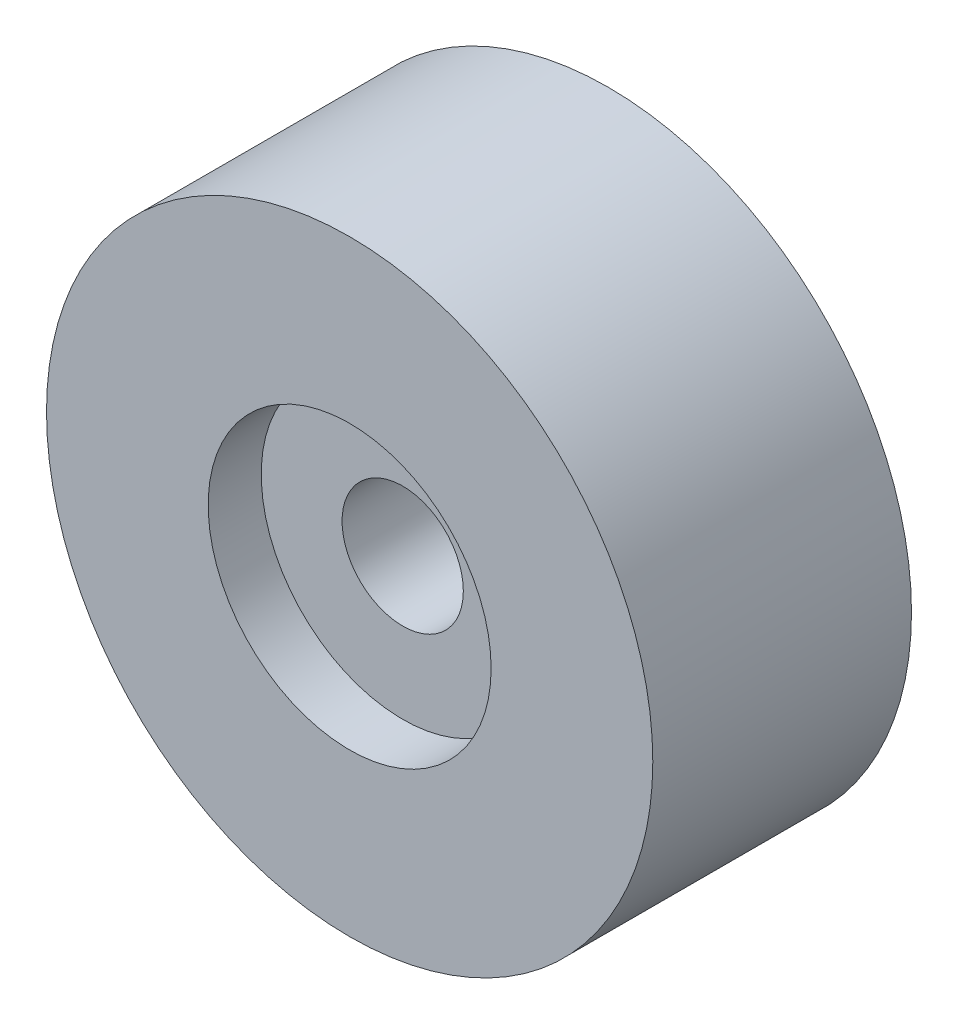
ISO-10303-21;
HEADER;
FILE_DESCRIPTION(('STEP AP214'),'2;1');
FILE_NAME('part.step','',(''),(''),'','','');
FILE_SCHEMA(('AUTOMOTIVE_DESIGN { 1 0 10303 214 1 1 1 1 }'));
ENDSEC;
DATA;
#1=APPLICATION_CONTEXT('core data for automotive mechanical design processes');
#2=APPLICATION_PROTOCOL_DEFINITION('international standard','automotive_design',2000,#1);
#3=PRODUCT_CONTEXT('',#1,'mechanical');
#4=PRODUCT('Part','Part','',(#3));
#5=PRODUCT_RELATED_PRODUCT_CATEGORY('part','',(#4));
#6=PRODUCT_DEFINITION_FORMATION('','',#4);
#7=PRODUCT_DEFINITION_CONTEXT('part definition',#1,'design');
#8=PRODUCT_DEFINITION('design','',#6,#7);
#9=PRODUCT_DEFINITION_SHAPE('','',#8);
#10=(LENGTH_UNIT() NAMED_UNIT(*) SI_UNIT(.MILLI.,.METRE.));
#11=(NAMED_UNIT(*) PLANE_ANGLE_UNIT() SI_UNIT($,.RADIAN.));
#12=(NAMED_UNIT(*) SI_UNIT($,.STERADIAN.) SOLID_ANGLE_UNIT());
#13=UNCERTAINTY_MEASURE_WITH_UNIT(LENGTH_MEASURE(1.E-05),#10,'distance_accuracy_value','');
#14=(GEOMETRIC_REPRESENTATION_CONTEXT(3) GLOBAL_UNCERTAINTY_ASSIGNED_CONTEXT((#13)) GLOBAL_UNIT_ASSIGNED_CONTEXT((#10,
#11,#12)) REPRESENTATION_CONTEXT('',''));
#15=CARTESIAN_POINT('',(0.,0.,0.));
#16=DIRECTION('',(0.,0.,1.));
#17=DIRECTION('',(1.,0.,0.));
#18=AXIS2_PLACEMENT_3D('',#15,#16,#17);
#19=CARTESIAN_POINT('',(0.,0.,25.6));
#20=DIRECTION('',(0.,0.,-1.));
#21=DIRECTION('',(-1.,0.,0.));
#22=AXIS2_PLACEMENT_3D('',#19,#20,#21);
#23=CYLINDRICAL_SURFACE('',#22,6.);
#24=CARTESIAN_POINT('',(0.,0.,0.));
#25=DIRECTION('',(0.,0.,1.));
#26=DIRECTION('',(1.,0.,0.));
#27=AXIS2_PLACEMENT_3D('',#24,#25,#26);
#28=CIRCLE('',#27,6.);
#29=CARTESIAN_POINT('',(6.,0.,0.));
#30=VERTEX_POINT('',#29);
#31=EDGE_CURVE('E44',#30,#30,#28,.T.);
#32=ORIENTED_EDGE('',*,*,#31,.F.);
#33=EDGE_LOOP('',(#32));
#34=FACE_BOUND('',#33,.T.);
#35=CARTESIAN_POINT('',(0.,0.,20.35));
#36=DIRECTION('',(0.,0.,1.));
#37=DIRECTION('',(1.,0.,0.));
#38=AXIS2_PLACEMENT_3D('',#35,#36,#37);
#39=CIRCLE('',#38,6.);
#40=CARTESIAN_POINT('',(6.,0.,20.35));
#41=VERTEX_POINT('',#40);
#42=EDGE_CURVE('E35',#41,#41,#39,.T.);
#43=ORIENTED_EDGE('',*,*,#42,.T.);
#44=EDGE_LOOP('',(#43));
#45=FACE_BOUND('',#44,.T.);
#46=ADVANCED_FACE('F31',(#34,#45),#23,.F.);
#47=CARTESIAN_POINT('',(0.,0.,25.6));
#48=DIRECTION('',(0.,0.,1.));
#49=DIRECTION('',(1.,0.,0.));
#50=AXIS2_PLACEMENT_3D('',#47,#48,#49);
#51=PLANE('',#50);
#52=CARTESIAN_POINT('',(0.,0.,25.6));
#53=DIRECTION('',(0.,0.,1.));
#54=DIRECTION('',(1.,0.,0.));
#55=AXIS2_PLACEMENT_3D('',#52,#53,#54);
#56=CIRCLE('',#55,14.);
#57=CARTESIAN_POINT('',(14.,0.,25.6));
#58=VERTEX_POINT('',#57);
#59=EDGE_CURVE('E48',#58,#58,#56,.T.);
#60=ORIENTED_EDGE('',*,*,#59,.F.);
#61=EDGE_LOOP('',(#60));
#62=FACE_BOUND('',#61,.T.);
#63=CARTESIAN_POINT('',(0.,0.,25.6));
#64=DIRECTION('',(0.,0.,1.));
#65=DIRECTION('',(1.,0.,0.));
#66=AXIS2_PLACEMENT_3D('',#63,#64,#65);
#67=CIRCLE('',#66,30.);
#68=CARTESIAN_POINT('',(30.,0.,25.6));
#69=VERTEX_POINT('',#68);
#70=EDGE_CURVE('E10',#69,#69,#67,.T.);
#71=ORIENTED_EDGE('',*,*,#70,.T.);
#72=EDGE_LOOP('',(#71));
#73=FACE_BOUND('',#72,.T.);
#74=ADVANCED_FACE('F69',(#62,#73),#51,.T.);
#75=CARTESIAN_POINT('',(0.,0.,0.));
#76=DIRECTION('',(0.,0.,1.));
#77=DIRECTION('',(1.,0.,0.));
#78=AXIS2_PLACEMENT_3D('',#75,#76,#77);
#79=PLANE('',#78);
#80=CARTESIAN_POINT('',(0.,0.,0.));
#81=DIRECTION('',(0.,0.,1.));
#82=DIRECTION('',(1.,0.,0.));
#83=AXIS2_PLACEMENT_3D('',#80,#81,#82);
#84=CIRCLE('',#83,30.);
#85=CARTESIAN_POINT('',(30.,0.,0.));
#86=VERTEX_POINT('',#85);
#87=EDGE_CURVE('E39',#86,#86,#84,.T.);
#88=ORIENTED_EDGE('',*,*,#87,.F.);
#89=EDGE_LOOP('',(#88));
#90=FACE_BOUND('',#89,.T.);
#91=ORIENTED_EDGE('',*,*,#31,.T.);
#92=EDGE_LOOP('',(#91));
#93=FACE_BOUND('',#92,.T.);
#94=ADVANCED_FACE('F75',(#90,#93),#79,.F.);
#95=CARTESIAN_POINT('',(0.,0.,25.6));
#96=DIRECTION('',(0.,0.,-1.));
#97=DIRECTION('',(-1.,0.,0.));
#98=AXIS2_PLACEMENT_3D('',#95,#96,#97);
#99=CYLINDRICAL_SURFACE('',#98,30.);
#100=ORIENTED_EDGE('',*,*,#70,.F.);
#101=EDGE_LOOP('',(#100));
#102=FACE_BOUND('',#101,.T.);
#103=ORIENTED_EDGE('',*,*,#87,.T.);
#104=EDGE_LOOP('',(#103));
#105=FACE_BOUND('',#104,.T.);
#106=ADVANCED_FACE('F33',(#102,#105),#99,.T.);
#107=CARTESIAN_POINT('',(0.,0.,20.35));
#108=DIRECTION('',(0.,0.,1.));
#109=DIRECTION('',(1.,0.,0.));
#110=AXIS2_PLACEMENT_3D('',#107,#108,#109);
#111=CYLINDRICAL_SURFACE('',#110,14.);
#112=CARTESIAN_POINT('',(0.,0.,20.35));
#113=DIRECTION('',(0.,0.,1.));
#114=DIRECTION('',(1.,0.,0.));
#115=AXIS2_PLACEMENT_3D('',#112,#113,#114);
#116=CIRCLE('',#115,14.);
#117=CARTESIAN_POINT('',(14.,0.,20.35));
#118=VERTEX_POINT('',#117);
#119=EDGE_CURVE('E51',#118,#118,#116,.T.);
#120=ORIENTED_EDGE('',*,*,#119,.F.);
#121=EDGE_LOOP('',(#120));
#122=FACE_BOUND('',#121,.T.);
#123=ORIENTED_EDGE('',*,*,#59,.T.);
#124=EDGE_LOOP('',(#123));
#125=FACE_BOUND('',#124,.T.);
#126=ADVANCED_FACE('F61',(#122,#125),#111,.F.);
#127=CARTESIAN_POINT('',(0.,0.,20.35));
#128=DIRECTION('',(0.,0.,1.));
#129=DIRECTION('',(1.,0.,0.));
#130=AXIS2_PLACEMENT_3D('',#127,#128,#129);
#131=PLANE('',#130);
#132=ORIENTED_EDGE('',*,*,#42,.F.);
#133=EDGE_LOOP('',(#132));
#134=FACE_BOUND('',#133,.T.);
#135=ORIENTED_EDGE('',*,*,#119,.T.);
#136=EDGE_LOOP('',(#135));
#137=FACE_BOUND('',#136,.T.);
#138=ADVANCED_FACE('F59',(#134,#137),#131,.T.);
#139=CLOSED_SHELL('',(#46,#74,#94,#106,#126,#138));
#140=MANIFOLD_SOLID_BREP('B2',#139);
#141=ADVANCED_BREP_SHAPE_REPRESENTATION('',(#18,#140),#14);
#142=SHAPE_DEFINITION_REPRESENTATION(#9,#141);
ENDSEC;
END-ISO-10303-21;
